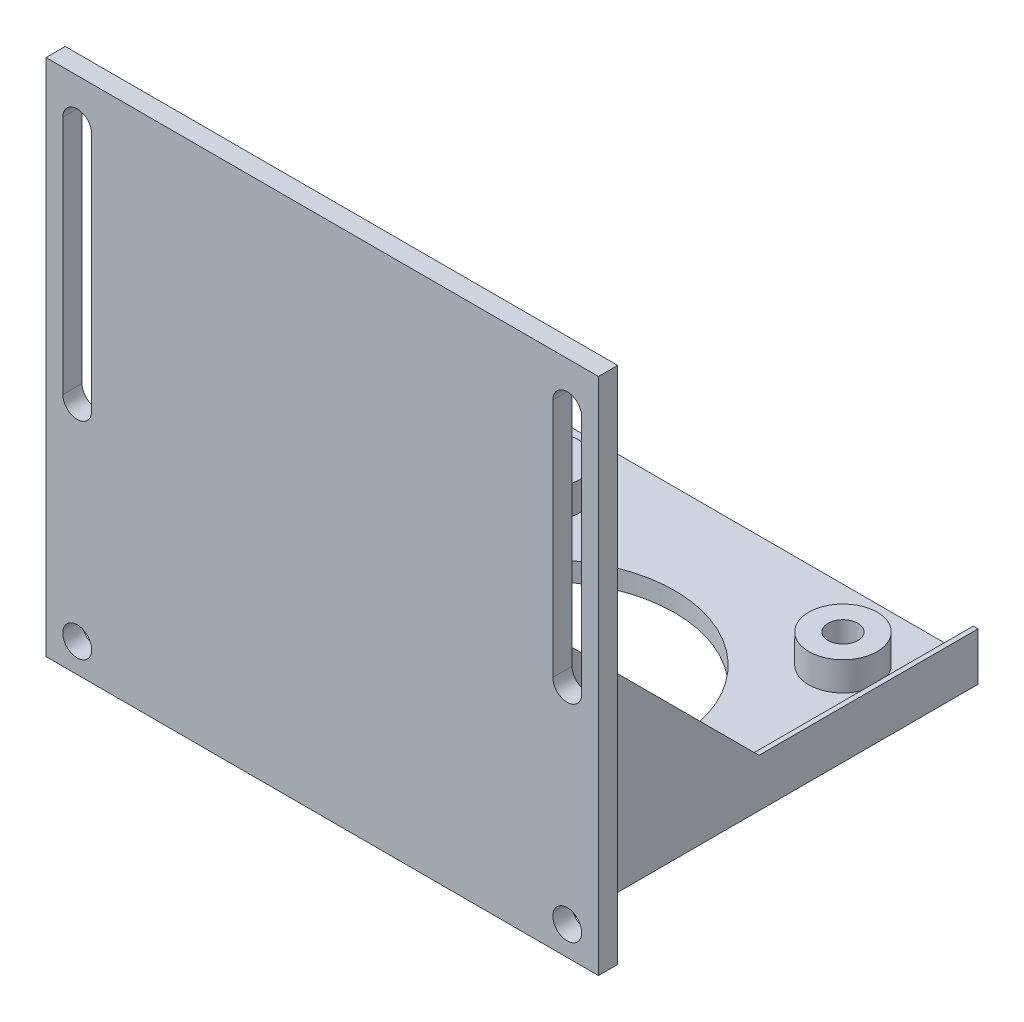
ISO-10303-21;
HEADER;
FILE_DESCRIPTION(('STEP AP214'),'2;1');
FILE_NAME('part.step','',(''),(''),'','','');
FILE_SCHEMA(('AUTOMOTIVE_DESIGN { 1 0 10303 214 1 1 1 1 }'));
ENDSEC;
DATA;
#1=APPLICATION_CONTEXT('core data for automotive mechanical design processes');
#2=APPLICATION_PROTOCOL_DEFINITION('international standard','automotive_design',2000,#1);
#3=PRODUCT_CONTEXT('',#1,'mechanical');
#4=PRODUCT('Part','Part','',(#3));
#5=PRODUCT_RELATED_PRODUCT_CATEGORY('part','',(#4));
#6=PRODUCT_DEFINITION_FORMATION('','',#4);
#7=PRODUCT_DEFINITION_CONTEXT('part definition',#1,'design');
#8=PRODUCT_DEFINITION('design','',#6,#7);
#9=PRODUCT_DEFINITION_SHAPE('','',#8);
#10=(LENGTH_UNIT() NAMED_UNIT(*) SI_UNIT(.MILLI.,.METRE.));
#11=(NAMED_UNIT(*) PLANE_ANGLE_UNIT() SI_UNIT($,.RADIAN.));
#12=(NAMED_UNIT(*) SI_UNIT($,.STERADIAN.) SOLID_ANGLE_UNIT());
#13=UNCERTAINTY_MEASURE_WITH_UNIT(LENGTH_MEASURE(1.E-05),#10,'distance_accuracy_value','');
#14=(GEOMETRIC_REPRESENTATION_CONTEXT(3) GLOBAL_UNCERTAINTY_ASSIGNED_CONTEXT((#13)) GLOBAL_UNIT_ASSIGNED_CONTEXT((#10,
#11,#12)) REPRESENTATION_CONTEXT('',''));
#15=CARTESIAN_POINT('',(0.,0.,0.));
#16=DIRECTION('',(0.,0.,1.));
#17=DIRECTION('',(1.,0.,0.));
#18=AXIS2_PLACEMENT_3D('',#15,#16,#17);
#19=CARTESIAN_POINT('',(-21.75,-3.,43.6033255612459));
#20=DIRECTION('',(0.,-1.,0.));
#21=DIRECTION('',(1.,0.,0.));
#22=AXIS2_PLACEMENT_3D('',#19,#20,#21);
#23=PLANE('',#22);
#24=CARTESIAN_POINT('',(15.494,-3.,-5.715));
#25=DIRECTION('',(0.,-1.,0.));
#26=DIRECTION('',(1.,0.,0.));
#27=AXIS2_PLACEMENT_3D('',#24,#25,#26);
#28=CIRCLE('',#27,3.55412658773653);
#29=CARTESIAN_POINT('',(19.0481265877365,-3.00000000000001,-5.715));
#30=VERTEX_POINT('',#29);
#31=EDGE_CURVE('E42',#30,#30,#28,.F.);
#32=ORIENTED_EDGE('',*,*,#31,.F.);
#33=EDGE_LOOP('',(#32));
#34=FACE_BOUND('',#33,.T.);
#35=CARTESIAN_POINT('',(-15.494,-3.,-36.703));
#36=DIRECTION('',(0.,-1.,0.));
#37=DIRECTION('',(1.,0.,0.));
#38=AXIS2_PLACEMENT_3D('',#35,#36,#37);
#39=CIRCLE('',#38,3.55412658773653);
#40=CARTESIAN_POINT('',(-11.9398734122635,-3.,-36.703));
#41=VERTEX_POINT('',#40);
#42=EDGE_CURVE('E111',#41,#41,#39,.F.);
#43=ORIENTED_EDGE('',*,*,#42,.F.);
#44=EDGE_LOOP('',(#43));
#45=FACE_BOUND('',#44,.T.);
#46=CARTESIAN_POINT('',(0.,-3.,-21.209));
#47=DIRECTION('',(0.,-1.,0.));
#48=DIRECTION('',(1.,0.,0.));
#49=AXIS2_PLACEMENT_3D('',#46,#47,#48);
#50=CIRCLE('',#49,13.462);
#51=CARTESIAN_POINT('',(13.462,-3.,-21.209));
#52=VERTEX_POINT('',#51);
#53=EDGE_CURVE('E130',#52,#52,#50,.T.);
#54=ORIENTED_EDGE('',*,*,#53,.T.);
#55=EDGE_LOOP('',(#54));
#56=FACE_BOUND('',#55,.T.);
#57=DIRECTION('',(0.,0.,-1.));
#58=VECTOR('',#57,1.);
#59=CARTESIAN_POINT('',(21.75,-3.00000000000001,43.6033255612459));
#60=LINE('',#59,#58);
#61=CARTESIAN_POINT('',(21.75,-3.00000000000001,0.));
#62=VERTEX_POINT('',#61);
#63=CARTESIAN_POINT('',(21.75,-3.00000000000001,-44.));
#64=VERTEX_POINT('',#63);
#65=EDGE_CURVE('E137',#62,#64,#60,.T.);
#66=ORIENTED_EDGE('',*,*,#65,.T.);
#67=DIRECTION('',(-1.,0.,0.));
#68=VECTOR('',#67,1.);
#69=CARTESIAN_POINT('',(-21.75,-3.,-44.));
#70=LINE('',#69,#68);
#71=CARTESIAN_POINT('',(-21.75,-3.,-44.));
#72=VERTEX_POINT('',#71);
#73=EDGE_CURVE('E587',#64,#72,#70,.T.);
#74=ORIENTED_EDGE('',*,*,#73,.T.);
#75=DIRECTION('',(0.,0.,-1.));
#76=VECTOR('',#75,1.);
#77=CARTESIAN_POINT('',(-21.75,-3.,43.6033255612459));
#78=LINE('',#77,#76);
#79=CARTESIAN_POINT('',(-21.75,-3.,0.));
#80=VERTEX_POINT('',#79);
#81=EDGE_CURVE('E583',#80,#72,#78,.T.);
#82=ORIENTED_EDGE('',*,*,#81,.F.);
#83=DIRECTION('',(-1.,0.,0.));
#84=VECTOR('',#83,1.);
#85=CARTESIAN_POINT('',(-21.75,-3.,0.));
#86=LINE('',#85,#84);
#87=EDGE_CURVE('E589',#62,#80,#86,.T.);
#88=ORIENTED_EDGE('',*,*,#87,.F.);
#89=EDGE_LOOP('',(#66,#74,#82,#88));
#90=FACE_BOUND('',#89,.T.);
#91=CARTESIAN_POINT('',(15.494,-3.,-36.703));
#92=DIRECTION('',(0.,-1.,0.));
#93=DIRECTION('',(1.,0.,0.));
#94=AXIS2_PLACEMENT_3D('',#91,#92,#93);
#95=CIRCLE('',#94,3.55412658773653);
#96=CARTESIAN_POINT('',(19.0481265877365,-3.00000000000001,-36.703));
#97=VERTEX_POINT('',#96);
#98=EDGE_CURVE('E114',#97,#97,#95,.F.);
#99=ORIENTED_EDGE('',*,*,#98,.F.);
#100=EDGE_LOOP('',(#99));
#101=FACE_BOUND('',#100,.T.);
#102=CARTESIAN_POINT('',(-15.494,-3.,-5.71500000000001));
#103=DIRECTION('',(0.,-1.,0.));
#104=DIRECTION('',(1.,0.,0.));
#105=AXIS2_PLACEMENT_3D('',#102,#103,#104);
#106=CIRCLE('',#105,3.55412658773653);
#107=CARTESIAN_POINT('',(-11.9398734122635,-3.,-5.71500000000001));
#108=VERTEX_POINT('',#107);
#109=EDGE_CURVE('E11',#108,#108,#106,.F.);
#110=ORIENTED_EDGE('',*,*,#109,.F.);
#111=EDGE_LOOP('',(#110));
#112=FACE_BOUND('',#111,.T.);
#113=ADVANCED_FACE('F34',(#34,#45,#56,#90,#101,#112),#23,.F.);
#114=CARTESIAN_POINT('',(0.,0.,0.));
#115=DIRECTION('',(0.,-1.,0.));
#116=DIRECTION('',(0.,0.,-1.));
#117=AXIS2_PLACEMENT_3D('',#114,#115,#116);
#118=PLANE('',#117);
#119=DIRECTION('',(1.,0.,0.));
#120=VECTOR('',#119,1.);
#121=CARTESIAN_POINT('',(22.25,0.,-44.));
#122=LINE('',#121,#120);
#123=CARTESIAN_POINT('',(21.75,0.,-44.));
#124=VERTEX_POINT('',#123);
#125=CARTESIAN_POINT('',(22.25,0.,-44.));
#126=VERTEX_POINT('',#125);
#127=EDGE_CURVE('E71',#124,#126,#122,.T.);
#128=ORIENTED_EDGE('',*,*,#127,.F.);
#129=DIRECTION('',(0.,0.,-1.));
#130=VECTOR('',#129,1.);
#131=CARTESIAN_POINT('',(21.75,0.,43.6033255612459));
#132=LINE('',#131,#130);
#133=CARTESIAN_POINT('',(21.75,0.,-21.209));
#134=VERTEX_POINT('',#133);
#135=EDGE_CURVE('E584',#134,#124,#132,.T.);
#136=ORIENTED_EDGE('',*,*,#135,.F.);
#137=DIRECTION('',(1.,0.,0.));
#138=VECTOR('',#137,1.);
#139=CARTESIAN_POINT('',(21.75,0.,-21.209));
#140=LINE('',#139,#138);
#141=CARTESIAN_POINT('',(22.25,0.,-21.209));
#142=VERTEX_POINT('',#141);
#143=EDGE_CURVE('E97',#134,#142,#140,.T.);
#144=ORIENTED_EDGE('',*,*,#143,.T.);
#145=DIRECTION('',(0.,0.,1.));
#146=VECTOR('',#145,1.);
#147=CARTESIAN_POINT('',(22.25,0.,-44.));
#148=LINE('',#147,#146);
#149=EDGE_CURVE('E90',#126,#142,#148,.T.);
#150=ORIENTED_EDGE('',*,*,#149,.F.);
#151=EDGE_LOOP('',(#128,#136,#144,#150));
#152=FACE_BOUND('',#151,.T.);
#153=ADVANCED_FACE('F95',(#152),#118,.F.);
#154=DIRECTION('',(-1.,0.,0.));
#155=VECTOR('',#154,1.);
#156=CARTESIAN_POINT('',(-21.75,0.,-21.209));
#157=LINE('',#156,#155);
#158=CARTESIAN_POINT('',(-21.75,0.,-21.209));
#159=VERTEX_POINT('',#158);
#160=CARTESIAN_POINT('',(-22.25,0.,-21.209));
#161=VERTEX_POINT('',#160);
#162=EDGE_CURVE('E374',#159,#161,#157,.T.);
#163=ORIENTED_EDGE('',*,*,#162,.F.);
#164=DIRECTION('',(0.,0.,-1.));
#165=VECTOR('',#164,1.);
#166=CARTESIAN_POINT('',(-21.75,0.,43.6033255612459));
#167=LINE('',#166,#165);
#168=CARTESIAN_POINT('',(-21.75,0.,-44.));
#169=VERTEX_POINT('',#168);
#170=EDGE_CURVE('E486',#159,#169,#167,.T.);
#171=ORIENTED_EDGE('',*,*,#170,.T.);
#172=CARTESIAN_POINT('',(-22.25,0.,-44.));
#173=VERTEX_POINT('',#172);
#174=EDGE_CURVE('E83',#173,#169,#122,.T.);
#175=ORIENTED_EDGE('',*,*,#174,.F.);
#176=DIRECTION('',(0.,0.,-1.));
#177=VECTOR('',#176,1.);
#178=CARTESIAN_POINT('',(-22.25,0.,-44.));
#179=LINE('',#178,#177);
#180=EDGE_CURVE('E84',#161,#173,#179,.T.);
#181=ORIENTED_EDGE('',*,*,#180,.F.);
#182=EDGE_LOOP('',(#163,#171,#175,#181));
#183=FACE_BOUND('',#182,.T.);
#184=ADVANCED_FACE('F250',(#183),#118,.F.);
#185=CARTESIAN_POINT('',(0.,0.,0.));
#186=DIRECTION('',(0.,0.,1.));
#187=DIRECTION('',(1.,0.,0.));
#188=AXIS2_PLACEMENT_3D('',#185,#186,#187);
#189=PLANE('',#188);
#190=CARTESIAN_POINT('',(-25.5,-1.99999999999999,0.));
#191=DIRECTION('',(0.,0.,-1.));
#192=DIRECTION('',(-1.,0.,0.));
#193=AXIS2_PLACEMENT_3D('',#190,#191,#192);
#194=CIRCLE('',#193,1.5);
#195=CARTESIAN_POINT('',(-27.,-1.99999999999999,0.));
#196=VERTEX_POINT('',#195);
#197=EDGE_CURVE('E320',#196,#196,#194,.T.);
#198=ORIENTED_EDGE('',*,*,#197,.F.);
#199=EDGE_LOOP('',(#198));
#200=FACE_BOUND('',#199,.T.);
#201=DIRECTION('',(0.,-1.,0.));
#202=VECTOR('',#201,1.);
#203=CARTESIAN_POINT('',(-24.,44.5,0.));
#204=LINE('',#203,#202);
#205=CARTESIAN_POINT('',(-24.,44.5,0.));
#206=VERTEX_POINT('',#205);
#207=CARTESIAN_POINT('',(-24.,19.5,0.));
#208=VERTEX_POINT('',#207);
#209=EDGE_CURVE('E310',#206,#208,#204,.T.);
#210=ORIENTED_EDGE('',*,*,#209,.F.);
#211=CARTESIAN_POINT('',(-25.5,44.5,0.));
#212=DIRECTION('',(0.,0.,-1.));
#213=DIRECTION('',(-1.,0.,0.));
#214=AXIS2_PLACEMENT_3D('',#211,#212,#213);
#215=CIRCLE('',#214,1.49999999999999);
#216=CARTESIAN_POINT('',(-27.,44.5,0.));
#217=VERTEX_POINT('',#216);
#218=EDGE_CURVE('E332',#217,#206,#215,.T.);
#219=ORIENTED_EDGE('',*,*,#218,.F.);
#220=DIRECTION('',(0.,1.,0.));
#221=VECTOR('',#220,1.);
#222=CARTESIAN_POINT('',(-27.,44.5,0.));
#223=LINE('',#222,#221);
#224=CARTESIAN_POINT('',(-27.,19.5,0.));
#225=VERTEX_POINT('',#224);
#226=EDGE_CURVE('E324',#225,#217,#223,.T.);
#227=ORIENTED_EDGE('',*,*,#226,.F.);
#228=CARTESIAN_POINT('',(-25.5,19.5,0.));
#229=DIRECTION('',(0.,0.,-1.));
#230=DIRECTION('',(-1.,0.,0.));
#231=AXIS2_PLACEMENT_3D('',#228,#229,#230);
#232=CIRCLE('',#231,1.49999999999999);
#233=EDGE_CURVE('E329',#208,#225,#232,.T.);
#234=ORIENTED_EDGE('',*,*,#233,.F.);
#235=EDGE_LOOP('',(#210,#219,#227,#234));
#236=FACE_BOUND('',#235,.T.);
#237=DIRECTION('',(1.,0.,0.));
#238=VECTOR('',#237,1.);
#239=CARTESIAN_POINT('',(21.75,21.2090000000002,0.));
#240=LINE('',#239,#238);
#241=CARTESIAN_POINT('',(21.75,21.2090000000002,0.));
#242=VERTEX_POINT('',#241);
#243=CARTESIAN_POINT('',(22.25,21.2090000000002,0.));
#244=VERTEX_POINT('',#243);
#245=EDGE_CURVE('E352',#242,#244,#240,.T.);
#246=ORIENTED_EDGE('',*,*,#245,.F.);
#247=DIRECTION('',(0.,1.,0.));
#248=VECTOR('',#247,1.);
#249=CARTESIAN_POINT('',(21.75,0.,0.));
#250=LINE('',#249,#248);
#251=EDGE_CURVE('E432',#62,#242,#250,.T.);
#252=ORIENTED_EDGE('',*,*,#251,.F.);
#253=ORIENTED_EDGE('',*,*,#87,.T.);
#254=DIRECTION('',(0.,1.,0.));
#255=VECTOR('',#254,1.);
#256=CARTESIAN_POINT('',(-21.75,0.,0.));
#257=LINE('',#256,#255);
#258=CARTESIAN_POINT('',(-21.75,21.2090000000002,0.));
#259=VERTEX_POINT('',#258);
#260=EDGE_CURVE('E366',#80,#259,#257,.T.);
#261=ORIENTED_EDGE('',*,*,#260,.T.);
#262=DIRECTION('',(-1.,0.,0.));
#263=VECTOR('',#262,1.);
#264=CARTESIAN_POINT('',(-21.75,21.2090000000002,0.));
#265=LINE('',#264,#263);
#266=CARTESIAN_POINT('',(-22.25,21.2090000000002,0.));
#267=VERTEX_POINT('',#266);
#268=EDGE_CURVE('E372',#259,#267,#265,.T.);
#269=ORIENTED_EDGE('',*,*,#268,.T.);
#270=DIRECTION('',(0.,-1.,0.));
#271=VECTOR('',#270,1.);
#272=CARTESIAN_POINT('',(-22.25,-5.,0.));
#273=LINE('',#272,#271);
#274=CARTESIAN_POINT('',(-22.25,-5.,0.));
#275=VERTEX_POINT('',#274);
#276=EDGE_CURVE('E110',#267,#275,#273,.T.);
#277=ORIENTED_EDGE('',*,*,#276,.T.);
#278=DIRECTION('',(-1.,0.,0.));
#279=VECTOR('',#278,1.);
#280=CARTESIAN_POINT('',(-22.25,-5.,0.));
#281=LINE('',#280,#279);
#282=CARTESIAN_POINT('',(-28.75,-5.,0.));
#283=VERTEX_POINT('',#282);
#284=EDGE_CURVE('E301',#275,#283,#281,.T.);
#285=ORIENTED_EDGE('',*,*,#284,.T.);
#286=DIRECTION('',(0.,1.,0.));
#287=VECTOR('',#286,1.);
#288=CARTESIAN_POINT('',(-28.75,-5.,0.));
#289=LINE('',#288,#287);
#290=CARTESIAN_POINT('',(-28.75,49.,0.));
#291=VERTEX_POINT('',#290);
#292=EDGE_CURVE('E309',#283,#291,#289,.T.);
#293=ORIENTED_EDGE('',*,*,#292,.T.);
#294=DIRECTION('',(-1.,0.,0.));
#295=VECTOR('',#294,1.);
#296=CARTESIAN_POINT('',(22.25,49.,0.));
#297=LINE('',#296,#295);
#298=CARTESIAN_POINT('',(28.75,49.,0.));
#299=VERTEX_POINT('',#298);
#300=EDGE_CURVE('E377',#299,#291,#297,.T.);
#301=ORIENTED_EDGE('',*,*,#300,.F.);
#302=DIRECTION('',(0.,1.,0.));
#303=VECTOR('',#302,1.);
#304=CARTESIAN_POINT('',(28.75,-5.,0.));
#305=LINE('',#304,#303);
#306=CARTESIAN_POINT('',(28.75,-5.,0.));
#307=VERTEX_POINT('',#306);
#308=EDGE_CURVE('E408',#307,#299,#305,.T.);
#309=ORIENTED_EDGE('',*,*,#308,.F.);
#310=DIRECTION('',(1.,0.,0.));
#311=VECTOR('',#310,1.);
#312=CARTESIAN_POINT('',(22.25,-5.,0.));
#313=LINE('',#312,#311);
#314=CARTESIAN_POINT('',(22.25,-5.,0.));
#315=VERTEX_POINT('',#314);
#316=EDGE_CURVE('E49',#315,#307,#313,.T.);
#317=ORIENTED_EDGE('',*,*,#316,.F.);
#318=DIRECTION('',(0.,-1.,0.));
#319=VECTOR('',#318,1.);
#320=CARTESIAN_POINT('',(22.25,-5.,0.));
#321=LINE('',#320,#319);
#322=EDGE_CURVE('E115',#244,#315,#321,.T.);
#323=ORIENTED_EDGE('',*,*,#322,.F.);
#324=EDGE_LOOP('',(#246,#252,#253,#261,#269,#277,#285,#293,#301,#309,#317,#323));
#325=FACE_BOUND('',#324,.T.);
#326=CARTESIAN_POINT('',(25.5,-1.99999999999999,0.));
#327=DIRECTION('',(0.,0.,1.));
#328=DIRECTION('',(1.,0.,0.));
#329=AXIS2_PLACEMENT_3D('',#326,#327,#328);
#330=CIRCLE('',#329,1.5);
#331=CARTESIAN_POINT('',(27.,-1.99999999999999,0.));
#332=VERTEX_POINT('',#331);
#333=EDGE_CURVE('E416',#332,#332,#330,.T.);
#334=ORIENTED_EDGE('',*,*,#333,.T.);
#335=EDGE_LOOP('',(#334));
#336=FACE_BOUND('',#335,.T.);
#337=CARTESIAN_POINT('',(25.5,44.5,0.));
#338=DIRECTION('',(0.,0.,1.));
#339=DIRECTION('',(1.,0.,0.));
#340=AXIS2_PLACEMENT_3D('',#337,#338,#339);
#341=CIRCLE('',#340,1.49999999999999);
#342=CARTESIAN_POINT('',(27.,44.5,0.));
#343=VERTEX_POINT('',#342);
#344=CARTESIAN_POINT('',(24.,44.5,0.));
#345=VERTEX_POINT('',#344);
#346=EDGE_CURVE('E535',#343,#345,#341,.T.);
#347=ORIENTED_EDGE('',*,*,#346,.T.);
#348=DIRECTION('',(0.,-1.,0.));
#349=VECTOR('',#348,1.);
#350=CARTESIAN_POINT('',(24.,44.5,0.));
#351=LINE('',#350,#349);
#352=CARTESIAN_POINT('',(24.,19.5,0.));
#353=VERTEX_POINT('',#352);
#354=EDGE_CURVE('E551',#345,#353,#351,.T.);
#355=ORIENTED_EDGE('',*,*,#354,.T.);
#356=CARTESIAN_POINT('',(25.5,19.5,0.));
#357=DIRECTION('',(0.,0.,1.));
#358=DIRECTION('',(1.,0.,0.));
#359=AXIS2_PLACEMENT_3D('',#356,#357,#358);
#360=CIRCLE('',#359,1.49999999999999);
#361=CARTESIAN_POINT('',(27.,19.5,0.));
#362=VERTEX_POINT('',#361);
#363=EDGE_CURVE('E548',#353,#362,#360,.T.);
#364=ORIENTED_EDGE('',*,*,#363,.T.);
#365=DIRECTION('',(0.,1.,0.));
#366=VECTOR('',#365,1.);
#367=CARTESIAN_POINT('',(27.,44.5,0.));
#368=LINE('',#367,#366);
#369=EDGE_CURVE('E539',#362,#343,#368,.T.);
#370=ORIENTED_EDGE('',*,*,#369,.T.);
#371=EDGE_LOOP('',(#347,#355,#364,#370));
#372=FACE_BOUND('',#371,.T.);
#373=ADVANCED_FACE('F246',(#200,#236,#325,#336,#372),#189,.F.);
#374=CARTESIAN_POINT('',(-22.25,-5.,-44.));
#375=DIRECTION('',(1.,0.,0.));
#376=DIRECTION('',(0.,0.,-1.));
#377=AXIS2_PLACEMENT_3D('',#374,#375,#376);
#378=PLANE('',#377);
#379=DIRECTION('',(0.,0.,-1.));
#380=VECTOR('',#379,1.);
#381=CARTESIAN_POINT('',(-22.25,-5.,-44.));
#382=LINE('',#381,#380);
#383=CARTESIAN_POINT('',(-22.25,-5.,-44.));
#384=VERTEX_POINT('',#383);
#385=EDGE_CURVE('E290',#275,#384,#382,.T.);
#386=ORIENTED_EDGE('',*,*,#385,.F.);
#387=ORIENTED_EDGE('',*,*,#276,.F.);
#388=DIRECTION('',(0.,-0.707106781186551,-0.707106781186544));
#389=VECTOR('',#388,1.);
#390=CARTESIAN_POINT('',(-22.25,0.,-21.209));
#391=LINE('',#390,#389);
#392=EDGE_CURVE('E338',#267,#161,#391,.T.);
#393=ORIENTED_EDGE('',*,*,#392,.T.);
#394=ORIENTED_EDGE('',*,*,#180,.T.);
#395=DIRECTION('',(0.,1.,0.));
#396=VECTOR('',#395,1.);
#397=CARTESIAN_POINT('',(-22.25,-5.,-44.));
#398=LINE('',#397,#396);
#399=EDGE_CURVE('E92',#384,#173,#398,.T.);
#400=ORIENTED_EDGE('',*,*,#399,.F.);
#401=EDGE_LOOP('',(#386,#387,#393,#394,#400));
#402=FACE_BOUND('',#401,.T.);
#403=ADVANCED_FACE('F249',(#402),#378,.F.);
#404=CARTESIAN_POINT('',(0.,-5.,0.));
#405=DIRECTION('',(0.,-1.,0.));
#406=DIRECTION('',(0.,0.,-1.));
#407=AXIS2_PLACEMENT_3D('',#404,#405,#406);
#408=PLANE('',#407);
#409=ORIENTED_EDGE('',*,*,#284,.F.);
#410=ORIENTED_EDGE('',*,*,#385,.T.);
#411=DIRECTION('',(1.,0.,0.));
#412=VECTOR('',#411,1.);
#413=CARTESIAN_POINT('',(22.25,-5.,-44.));
#414=LINE('',#413,#412);
#415=CARTESIAN_POINT('',(22.25,-5.,-44.));
#416=VERTEX_POINT('',#415);
#417=EDGE_CURVE('E58',#384,#416,#414,.T.);
#418=ORIENTED_EDGE('',*,*,#417,.T.);
#419=DIRECTION('',(0.,0.,1.));
#420=VECTOR('',#419,1.);
#421=CARTESIAN_POINT('',(22.25,-5.,-44.));
#422=LINE('',#421,#420);
#423=EDGE_CURVE('E91',#416,#315,#422,.T.);
#424=ORIENTED_EDGE('',*,*,#423,.T.);
#425=ORIENTED_EDGE('',*,*,#316,.T.);
#426=DIRECTION('',(0.,0.,-1.));
#427=VECTOR('',#426,1.);
#428=CARTESIAN_POINT('',(28.75,-5.,56.3897968372745));
#429=LINE('',#428,#427);
#430=CARTESIAN_POINT('',(28.75,-5.,2.));
#431=VERTEX_POINT('',#430);
#432=EDGE_CURVE('E403',#431,#307,#429,.T.);
#433=ORIENTED_EDGE('',*,*,#432,.F.);
#434=DIRECTION('',(1.,0.,0.));
#435=VECTOR('',#434,1.);
#436=CARTESIAN_POINT('',(22.25,-5.,2.));
#437=LINE('',#436,#435);
#438=CARTESIAN_POINT('',(-28.75,-5.,2.));
#439=VERTEX_POINT('',#438);
#440=EDGE_CURVE('E383',#439,#431,#437,.T.);
#441=ORIENTED_EDGE('',*,*,#440,.F.);
#442=DIRECTION('',(0.,0.,-1.));
#443=VECTOR('',#442,1.);
#444=CARTESIAN_POINT('',(-28.75,-5.,56.3897968372745));
#445=LINE('',#444,#443);
#446=EDGE_CURVE('E306',#439,#283,#445,.T.);
#447=ORIENTED_EDGE('',*,*,#446,.T.);
#448=EDGE_LOOP('',(#409,#410,#418,#424,#425,#433,#441,#447));
#449=FACE_BOUND('',#448,.T.);
#450=CARTESIAN_POINT('',(-15.494,-5.,-36.703));
#451=DIRECTION('',(0.,-1.,0.));
#452=DIRECTION('',(0.,0.,-1.));
#453=AXIS2_PLACEMENT_3D('',#450,#451,#452);
#454=CIRCLE('',#453,1.55412658773653);
#455=CARTESIAN_POINT('',(-15.494,-5.,-38.2571265877365));
#456=VERTEX_POINT('',#455);
#457=EDGE_CURVE('E391',#456,#456,#454,.T.);
#458=ORIENTED_EDGE('',*,*,#457,.F.);
#459=EDGE_LOOP('',(#458));
#460=FACE_BOUND('',#459,.T.);
#461=CARTESIAN_POINT('',(15.494,-5.,-5.715));
#462=DIRECTION('',(0.,-1.,0.));
#463=DIRECTION('',(0.,0.,-1.));
#464=AXIS2_PLACEMENT_3D('',#461,#462,#463);
#465=CIRCLE('',#464,1.55412658773653);
#466=CARTESIAN_POINT('',(15.494,-5.,-7.26912658773653));
#467=VERTEX_POINT('',#466);
#468=EDGE_CURVE('E102',#467,#467,#465,.T.);
#469=ORIENTED_EDGE('',*,*,#468,.F.);
#470=EDGE_LOOP('',(#469));
#471=FACE_BOUND('',#470,.T.);
#472=CARTESIAN_POINT('',(0.,-5.,-21.209));
#473=DIRECTION('',(0.,-1.,0.));
#474=DIRECTION('',(0.,0.,-1.));
#475=AXIS2_PLACEMENT_3D('',#472,#473,#474);
#476=CIRCLE('',#475,13.462);
#477=CARTESIAN_POINT('',(0.,-5.,-34.671));
#478=VERTEX_POINT('',#477);
#479=EDGE_CURVE('E98',#478,#478,#476,.T.);
#480=ORIENTED_EDGE('',*,*,#479,.F.);
#481=EDGE_LOOP('',(#480));
#482=FACE_BOUND('',#481,.T.);
#483=CARTESIAN_POINT('',(-15.494,-5.,-5.71500000000001));
#484=DIRECTION('',(0.,-1.,0.));
#485=DIRECTION('',(0.,0.,-1.));
#486=AXIS2_PLACEMENT_3D('',#483,#484,#485);
#487=CIRCLE('',#486,1.55412658773653);
#488=CARTESIAN_POINT('',(-15.494,-5.,-7.26912658773653));
#489=VERTEX_POINT('',#488);
#490=EDGE_CURVE('E394',#489,#489,#487,.T.);
#491=ORIENTED_EDGE('',*,*,#490,.F.);
#492=EDGE_LOOP('',(#491));
#493=FACE_BOUND('',#492,.T.);
#494=CARTESIAN_POINT('',(15.494,-5.,-36.703));
#495=DIRECTION('',(0.,-1.,0.));
#496=DIRECTION('',(0.,0.,-1.));
#497=AXIS2_PLACEMENT_3D('',#494,#495,#496);
#498=CIRCLE('',#497,1.55412658773653);
#499=CARTESIAN_POINT('',(15.494,-5.,-38.2571265877365));
#500=VERTEX_POINT('',#499);
#501=EDGE_CURVE('E386',#500,#500,#498,.T.);
#502=ORIENTED_EDGE('',*,*,#501,.F.);
#503=EDGE_LOOP('',(#502));
#504=FACE_BOUND('',#503,.T.);
#505=ADVANCED_FACE('F275',(#449,#460,#471,#482,#493,#504),#408,.T.);
#506=CARTESIAN_POINT('',(22.25,-5.,-44.));
#507=DIRECTION('',(-1.,0.,0.));
#508=DIRECTION('',(0.,0.,1.));
#509=AXIS2_PLACEMENT_3D('',#506,#507,#508);
#510=PLANE('',#509);
#511=DIRECTION('',(0.,-0.707106781186551,-0.707106781186544));
#512=VECTOR('',#511,1.);
#513=CARTESIAN_POINT('',(22.25,0.,-21.209));
#514=LINE('',#513,#512);
#515=EDGE_CURVE('E428',#244,#142,#514,.T.);
#516=ORIENTED_EDGE('',*,*,#515,.F.);
#517=ORIENTED_EDGE('',*,*,#322,.T.);
#518=ORIENTED_EDGE('',*,*,#423,.F.);
#519=DIRECTION('',(0.,1.,0.));
#520=VECTOR('',#519,1.);
#521=CARTESIAN_POINT('',(22.25,-5.,-44.));
#522=LINE('',#521,#520);
#523=EDGE_CURVE('E75',#416,#126,#522,.T.);
#524=ORIENTED_EDGE('',*,*,#523,.T.);
#525=ORIENTED_EDGE('',*,*,#149,.T.);
#526=EDGE_LOOP('',(#516,#517,#518,#524,#525));
#527=FACE_BOUND('',#526,.T.);
#528=ADVANCED_FACE('F36',(#527),#510,.F.);
#529=CARTESIAN_POINT('',(22.25,-5.,-44.));
#530=DIRECTION('',(0.,0.,1.));
#531=DIRECTION('',(1.,0.,0.));
#532=AXIS2_PLACEMENT_3D('',#529,#530,#531);
#533=PLANE('',#532);
#534=ORIENTED_EDGE('',*,*,#73,.F.);
#535=DIRECTION('',(0.,-1.,0.));
#536=VECTOR('',#535,1.);
#537=CARTESIAN_POINT('',(21.75,0.,-44.));
#538=LINE('',#537,#536);
#539=EDGE_CURVE('E79',#124,#64,#538,.T.);
#540=ORIENTED_EDGE('',*,*,#539,.F.);
#541=ORIENTED_EDGE('',*,*,#127,.T.);
#542=ORIENTED_EDGE('',*,*,#523,.F.);
#543=ORIENTED_EDGE('',*,*,#417,.F.);
#544=ORIENTED_EDGE('',*,*,#399,.T.);
#545=ORIENTED_EDGE('',*,*,#174,.T.);
#546=DIRECTION('',(0.,1.,0.));
#547=VECTOR('',#546,1.);
#548=CARTESIAN_POINT('',(-21.75,0.,-44.));
#549=LINE('',#548,#547);
#550=EDGE_CURVE('E490',#72,#169,#549,.T.);
#551=ORIENTED_EDGE('',*,*,#550,.F.);
#552=EDGE_LOOP('',(#534,#540,#541,#542,#543,#544,#545,#551));
#553=FACE_BOUND('',#552,.T.);
#554=ADVANCED_FACE('F74',(#553),#533,.F.);
#555=CARTESIAN_POINT('',(0.,-5.,-21.209));
#556=DIRECTION('',(0.,1.,0.));
#557=DIRECTION('',(0.,0.,1.));
#558=AXIS2_PLACEMENT_3D('',#555,#556,#557);
#559=CYLINDRICAL_SURFACE('',#558,13.462);
#560=ORIENTED_EDGE('',*,*,#53,.F.);
#561=EDGE_LOOP('',(#560));
#562=FACE_BOUND('',#561,.T.);
#563=ORIENTED_EDGE('',*,*,#479,.T.);
#564=EDGE_LOOP('',(#563));
#565=FACE_BOUND('',#564,.T.);
#566=ADVANCED_FACE('F270',(#562,#565),#559,.F.);
#567=CARTESIAN_POINT('',(15.494,-5.,-5.715));
#568=DIRECTION('',(0.,1.,0.));
#569=DIRECTION('',(0.,0.,1.));
#570=AXIS2_PLACEMENT_3D('',#567,#568,#569);
#571=CYLINDRICAL_SURFACE('',#570,1.55412658773653);
#572=ORIENTED_EDGE('',*,*,#468,.T.);
#573=EDGE_LOOP('',(#572));
#574=FACE_BOUND('',#573,.T.);
#575=CARTESIAN_POINT('',(15.494,0.,-5.715));
#576=DIRECTION('',(0.,1.,0.));
#577=DIRECTION('',(-1.,0.,0.));
#578=AXIS2_PLACEMENT_3D('',#575,#576,#577);
#579=CIRCLE('',#578,1.55412658773653);
#580=CARTESIAN_POINT('',(13.9398734122635,0.,-5.715));
#581=VERTEX_POINT('',#580);
#582=EDGE_CURVE('E610',#581,#581,#579,.T.);
#583=ORIENTED_EDGE('',*,*,#582,.T.);
#584=EDGE_LOOP('',(#583));
#585=FACE_BOUND('',#584,.T.);
#586=ADVANCED_FACE('F266',(#574,#585),#571,.F.);
#587=CARTESIAN_POINT('',(-15.494,-5.,-5.71500000000001));
#588=DIRECTION('',(0.,1.,0.));
#589=DIRECTION('',(0.,0.,1.));
#590=AXIS2_PLACEMENT_3D('',#587,#588,#589);
#591=CYLINDRICAL_SURFACE('',#590,1.55412658773653);
#592=ORIENTED_EDGE('',*,*,#490,.T.);
#593=EDGE_LOOP('',(#592));
#594=FACE_BOUND('',#593,.T.);
#595=CARTESIAN_POINT('',(-15.494,0.,-5.71500000000001));
#596=DIRECTION('',(0.,1.,0.));
#597=DIRECTION('',(-1.,0.,0.));
#598=AXIS2_PLACEMENT_3D('',#595,#596,#597);
#599=CIRCLE('',#598,1.55412658773653);
#600=CARTESIAN_POINT('',(-17.0481265877365,0.,-5.71500000000001));
#601=VERTEX_POINT('',#600);
#602=EDGE_CURVE('E616',#601,#601,#599,.T.);
#603=ORIENTED_EDGE('',*,*,#602,.T.);
#604=EDGE_LOOP('',(#603));
#605=FACE_BOUND('',#604,.T.);
#606=ADVANCED_FACE('F262',(#594,#605),#591,.F.);
#607=CARTESIAN_POINT('',(-15.494,-5.,-36.703));
#608=DIRECTION('',(0.,1.,0.));
#609=DIRECTION('',(0.,0.,1.));
#610=AXIS2_PLACEMENT_3D('',#607,#608,#609);
#611=CYLINDRICAL_SURFACE('',#610,1.55412658773653);
#612=ORIENTED_EDGE('',*,*,#457,.T.);
#613=EDGE_LOOP('',(#612));
#614=FACE_BOUND('',#613,.T.);
#615=CARTESIAN_POINT('',(-15.494,0.,-36.703));
#616=DIRECTION('',(0.,1.,0.));
#617=DIRECTION('',(-1.,0.,0.));
#618=AXIS2_PLACEMENT_3D('',#615,#616,#617);
#619=CIRCLE('',#618,1.55412658773653);
#620=CARTESIAN_POINT('',(-17.0481265877365,0.,-36.703));
#621=VERTEX_POINT('',#620);
#622=EDGE_CURVE('E598',#621,#621,#619,.T.);
#623=ORIENTED_EDGE('',*,*,#622,.T.);
#624=EDGE_LOOP('',(#623));
#625=FACE_BOUND('',#624,.T.);
#626=ADVANCED_FACE('F258',(#614,#625),#611,.F.);
#627=CARTESIAN_POINT('',(15.494,-5.,-36.703));
#628=DIRECTION('',(0.,1.,0.));
#629=DIRECTION('',(0.,0.,1.));
#630=AXIS2_PLACEMENT_3D('',#627,#628,#629);
#631=CYLINDRICAL_SURFACE('',#630,1.55412658773653);
#632=ORIENTED_EDGE('',*,*,#501,.T.);
#633=EDGE_LOOP('',(#632));
#634=FACE_BOUND('',#633,.T.);
#635=CARTESIAN_POINT('',(15.494,0.,-36.703));
#636=DIRECTION('',(0.,1.,0.));
#637=DIRECTION('',(-1.,0.,0.));
#638=AXIS2_PLACEMENT_3D('',#635,#636,#637);
#639=CIRCLE('',#638,1.55412658773653);
#640=CARTESIAN_POINT('',(13.9398734122635,0.,-36.703));
#641=VERTEX_POINT('',#640);
#642=EDGE_CURVE('E604',#641,#641,#639,.T.);
#643=ORIENTED_EDGE('',*,*,#642,.T.);
#644=EDGE_LOOP('',(#643));
#645=FACE_BOUND('',#644,.T.);
#646=ADVANCED_FACE('F254',(#634,#645),#631,.F.);
#647=CARTESIAN_POINT('',(22.25,49.,2.));
#648=DIRECTION('',(0.,-1.,0.));
#649=DIRECTION('',(0.,0.,-1.));
#650=AXIS2_PLACEMENT_3D('',#647,#648,#649);
#651=PLANE('',#650);
#652=DIRECTION('',(0.,0.,-1.));
#653=VECTOR('',#652,1.);
#654=CARTESIAN_POINT('',(-28.75,49.,56.3897968372745));
#655=LINE('',#654,#653);
#656=CARTESIAN_POINT('',(-28.75,49.,2.));
#657=VERTEX_POINT('',#656);
#658=EDGE_CURVE('E351',#657,#291,#655,.T.);
#659=ORIENTED_EDGE('',*,*,#658,.F.);
#660=DIRECTION('',(-1.,0.,0.));
#661=VECTOR('',#660,1.);
#662=CARTESIAN_POINT('',(22.25,49.,2.));
#663=LINE('',#662,#661);
#664=CARTESIAN_POINT('',(28.75,49.,2.));
#665=VERTEX_POINT('',#664);
#666=EDGE_CURVE('E380',#665,#657,#663,.T.);
#667=ORIENTED_EDGE('',*,*,#666,.F.);
#668=DIRECTION('',(0.,0.,-1.));
#669=VECTOR('',#668,1.);
#670=CARTESIAN_POINT('',(28.75,49.,56.3897968372745));
#671=LINE('',#670,#669);
#672=EDGE_CURVE('E407',#665,#299,#671,.T.);
#673=ORIENTED_EDGE('',*,*,#672,.T.);
#674=ORIENTED_EDGE('',*,*,#300,.T.);
#675=EDGE_LOOP('',(#659,#667,#673,#674));
#676=FACE_BOUND('',#675,.T.);
#677=ADVANCED_FACE('F244',(#676),#651,.F.);
#678=CARTESIAN_POINT('',(0.,0.,2.));
#679=DIRECTION('',(0.,0.,1.));
#680=DIRECTION('',(1.,0.,0.));
#681=AXIS2_PLACEMENT_3D('',#678,#679,#680);
#682=PLANE('',#681);
#683=ORIENTED_EDGE('',*,*,#440,.T.);
#684=DIRECTION('',(0.,1.,0.));
#685=VECTOR('',#684,1.);
#686=CARTESIAN_POINT('',(28.75,-5.,2.));
#687=LINE('',#686,#685);
#688=EDGE_CURVE('E533',#431,#665,#687,.T.);
#689=ORIENTED_EDGE('',*,*,#688,.T.);
#690=ORIENTED_EDGE('',*,*,#666,.T.);
#691=DIRECTION('',(0.,1.,0.));
#692=VECTOR('',#691,1.);
#693=CARTESIAN_POINT('',(-28.75,-5.,2.));
#694=LINE('',#693,#692);
#695=EDGE_CURVE('E348',#439,#657,#694,.T.);
#696=ORIENTED_EDGE('',*,*,#695,.F.);
#697=EDGE_LOOP('',(#683,#689,#690,#696));
#698=FACE_BOUND('',#697,.T.);
#699=DIRECTION('',(0.,1.,0.));
#700=VECTOR('',#699,1.);
#701=CARTESIAN_POINT('',(-27.,44.5,2.));
#702=LINE('',#701,#700);
#703=CARTESIAN_POINT('',(-27.,19.5,2.));
#704=VERTEX_POINT('',#703);
#705=CARTESIAN_POINT('',(-27.,44.5,2.));
#706=VERTEX_POINT('',#705);
#707=EDGE_CURVE('E312',#704,#706,#702,.T.);
#708=ORIENTED_EDGE('',*,*,#707,.T.);
#709=CARTESIAN_POINT('',(-25.5,44.5,2.));
#710=DIRECTION('',(0.,0.,1.));
#711=DIRECTION('',(1.,0.,0.));
#712=AXIS2_PLACEMENT_3D('',#709,#710,#711);
#713=CIRCLE('',#712,1.49999999999999);
#714=CARTESIAN_POINT('',(-24.,44.5,2.));
#715=VERTEX_POINT('',#714);
#716=EDGE_CURVE('E340',#706,#715,#713,.F.);
#717=ORIENTED_EDGE('',*,*,#716,.T.);
#718=DIRECTION('',(0.,-1.,0.));
#719=VECTOR('',#718,1.);
#720=CARTESIAN_POINT('',(-24.,44.5,2.));
#721=LINE('',#720,#719);
#722=CARTESIAN_POINT('',(-24.,19.5,2.));
#723=VERTEX_POINT('',#722);
#724=EDGE_CURVE('E343',#715,#723,#721,.T.);
#725=ORIENTED_EDGE('',*,*,#724,.T.);
#726=CARTESIAN_POINT('',(-25.5,19.5,2.));
#727=DIRECTION('',(0.,0.,1.));
#728=DIRECTION('',(1.,0.,0.));
#729=AXIS2_PLACEMENT_3D('',#726,#727,#728);
#730=CIRCLE('',#729,1.49999999999999);
#731=EDGE_CURVE('E339',#723,#704,#730,.F.);
#732=ORIENTED_EDGE('',*,*,#731,.T.);
#733=EDGE_LOOP('',(#708,#717,#725,#732));
#734=FACE_BOUND('',#733,.T.);
#735=CARTESIAN_POINT('',(-25.5,-1.99999999999999,2.));
#736=DIRECTION('',(0.,0.,1.));
#737=DIRECTION('',(1.,0.,0.));
#738=AXIS2_PLACEMENT_3D('',#735,#736,#737);
#739=CIRCLE('',#738,1.5);
#740=CARTESIAN_POINT('',(-24.,-1.99999999999999,2.));
#741=VERTEX_POINT('',#740);
#742=EDGE_CURVE('E335',#741,#741,#739,.F.);
#743=ORIENTED_EDGE('',*,*,#742,.T.);
#744=EDGE_LOOP('',(#743));
#745=FACE_BOUND('',#744,.T.);
#746=CARTESIAN_POINT('',(25.5,44.5,2.));
#747=DIRECTION('',(0.,0.,1.));
#748=DIRECTION('',(1.,0.,0.));
#749=AXIS2_PLACEMENT_3D('',#746,#747,#748);
#750=CIRCLE('',#749,1.49999999999999);
#751=CARTESIAN_POINT('',(27.,44.5,2.));
#752=VERTEX_POINT('',#751);
#753=CARTESIAN_POINT('',(24.,44.5,2.));
#754=VERTEX_POINT('',#753);
#755=EDGE_CURVE('E542',#752,#754,#750,.T.);
#756=ORIENTED_EDGE('',*,*,#755,.F.);
#757=DIRECTION('',(0.,1.,0.));
#758=VECTOR('',#757,1.);
#759=CARTESIAN_POINT('',(27.,44.5,2.));
#760=LINE('',#759,#758);
#761=CARTESIAN_POINT('',(27.,19.5,2.));
#762=VERTEX_POINT('',#761);
#763=EDGE_CURVE('E424',#762,#752,#760,.T.);
#764=ORIENTED_EDGE('',*,*,#763,.F.);
#765=CARTESIAN_POINT('',(25.5,19.5,2.));
#766=DIRECTION('',(0.,0.,1.));
#767=DIRECTION('',(1.,0.,0.));
#768=AXIS2_PLACEMENT_3D('',#765,#766,#767);
#769=CIRCLE('',#768,1.49999999999999);
#770=CARTESIAN_POINT('',(24.,19.5,2.));
#771=VERTEX_POINT('',#770);
#772=EDGE_CURVE('E572',#771,#762,#769,.T.);
#773=ORIENTED_EDGE('',*,*,#772,.F.);
#774=DIRECTION('',(0.,-1.,0.));
#775=VECTOR('',#774,1.);
#776=CARTESIAN_POINT('',(24.,44.5,2.));
#777=LINE('',#776,#775);
#778=EDGE_CURVE('E574',#754,#771,#777,.T.);
#779=ORIENTED_EDGE('',*,*,#778,.F.);
#780=EDGE_LOOP('',(#756,#764,#773,#779));
#781=FACE_BOUND('',#780,.T.);
#782=CARTESIAN_POINT('',(25.5,-1.99999999999999,2.));
#783=DIRECTION('',(0.,0.,1.));
#784=DIRECTION('',(1.,0.,0.));
#785=AXIS2_PLACEMENT_3D('',#782,#783,#784);
#786=CIRCLE('',#785,1.5);
#787=CARTESIAN_POINT('',(27.,-1.99999999999999,2.));
#788=VERTEX_POINT('',#787);
#789=EDGE_CURVE('E536',#788,#788,#786,.T.);
#790=ORIENTED_EDGE('',*,*,#789,.F.);
#791=EDGE_LOOP('',(#790));
#792=FACE_BOUND('',#791,.T.);
#793=ADVANCED_FACE('F240',(#698,#734,#745,#781,#792),#682,.T.);
#794=CARTESIAN_POINT('',(-21.75,0.,-21.209));
#795=DIRECTION('',(0.,0.707106781186544,-0.707106781186552));
#796=DIRECTION('',(0.,0.707106781186551,0.707106781186544));
#797=AXIS2_PLACEMENT_3D('',#794,#795,#796);
#798=PLANE('',#797);
#799=ORIENTED_EDGE('',*,*,#392,.F.);
#800=ORIENTED_EDGE('',*,*,#268,.F.);
#801=DIRECTION('',(0.,-0.707106781186551,-0.707106781186544));
#802=VECTOR('',#801,1.);
#803=CARTESIAN_POINT('',(-21.75,0.,-21.209));
#804=LINE('',#803,#802);
#805=EDGE_CURVE('E369',#259,#159,#804,.T.);
#806=ORIENTED_EDGE('',*,*,#805,.T.);
#807=ORIENTED_EDGE('',*,*,#162,.T.);
#808=EDGE_LOOP('',(#799,#800,#806,#807));
#809=FACE_BOUND('',#808,.T.);
#810=ADVANCED_FACE('F236',(#809),#798,.T.);
#811=CARTESIAN_POINT('',(-21.75,0.,0.));
#812=DIRECTION('',(-1.,0.,0.));
#813=DIRECTION('',(0.,0.,1.));
#814=AXIS2_PLACEMENT_3D('',#811,#812,#813);
#815=PLANE('',#814);
#816=ORIENTED_EDGE('',*,*,#260,.F.);
#817=ORIENTED_EDGE('',*,*,#81,.T.);
#818=ORIENTED_EDGE('',*,*,#550,.T.);
#819=ORIENTED_EDGE('',*,*,#170,.F.);
#820=ORIENTED_EDGE('',*,*,#805,.F.);
#821=EDGE_LOOP('',(#816,#817,#818,#819,#820));
#822=FACE_BOUND('',#821,.T.);
#823=ADVANCED_FACE('F214',(#822),#815,.F.);
#824=CARTESIAN_POINT('',(-28.75,-5.,56.3897968372745));
#825=DIRECTION('',(-1.,0.,0.));
#826=DIRECTION('',(0.,-1.,0.));
#827=AXIS2_PLACEMENT_3D('',#824,#825,#826);
#828=PLANE('',#827);
#829=ORIENTED_EDGE('',*,*,#446,.F.);
#830=ORIENTED_EDGE('',*,*,#695,.T.);
#831=ORIENTED_EDGE('',*,*,#658,.T.);
#832=ORIENTED_EDGE('',*,*,#292,.F.);
#833=EDGE_LOOP('',(#829,#830,#831,#832));
#834=FACE_BOUND('',#833,.T.);
#835=ADVANCED_FACE('F210',(#834),#828,.T.);
#836=CARTESIAN_POINT('',(-25.5,-1.99999999999999,56.3897968372745));
#837=DIRECTION('',(0.,0.,-1.));
#838=DIRECTION('',(-1.,0.,0.));
#839=AXIS2_PLACEMENT_3D('',#836,#837,#838);
#840=CYLINDRICAL_SURFACE('',#839,1.5);
#841=ORIENTED_EDGE('',*,*,#197,.T.);
#842=EDGE_LOOP('',(#841));
#843=FACE_BOUND('',#842,.T.);
#844=ORIENTED_EDGE('',*,*,#742,.F.);
#845=EDGE_LOOP('',(#844));
#846=FACE_BOUND('',#845,.T.);
#847=ADVANCED_FACE('F213',(#843,#846),#840,.F.);
#848=CARTESIAN_POINT('',(-25.5,44.5,56.3897968372745));
#849=DIRECTION('',(0.,0.,-1.));
#850=DIRECTION('',(-1.,0.,0.));
#851=AXIS2_PLACEMENT_3D('',#848,#849,#850);
#852=CYLINDRICAL_SURFACE('',#851,1.49999999999999);
#853=ORIENTED_EDGE('',*,*,#716,.F.);
#854=DIRECTION('',(0.,0.,-1.));
#855=VECTOR('',#854,1.);
#856=CARTESIAN_POINT('',(-27.,44.5,56.3897968372745));
#857=LINE('',#856,#855);
#858=EDGE_CURVE('E323',#706,#217,#857,.T.);
#859=ORIENTED_EDGE('',*,*,#858,.T.);
#860=ORIENTED_EDGE('',*,*,#218,.T.);
#861=DIRECTION('',(0.,0.,-1.));
#862=VECTOR('',#861,1.);
#863=CARTESIAN_POINT('',(-24.,44.5,56.3897968372745));
#864=LINE('',#863,#862);
#865=EDGE_CURVE('E315',#715,#206,#864,.T.);
#866=ORIENTED_EDGE('',*,*,#865,.F.);
#867=EDGE_LOOP('',(#853,#859,#860,#866));
#868=FACE_BOUND('',#867,.T.);
#869=ADVANCED_FACE('F218',(#868),#852,.F.);
#870=CARTESIAN_POINT('',(-27.,44.5,56.3897968372745));
#871=DIRECTION('',(-1.,0.,0.));
#872=DIRECTION('',(0.,0.,1.));
#873=AXIS2_PLACEMENT_3D('',#870,#871,#872);
#874=PLANE('',#873);
#875=ORIENTED_EDGE('',*,*,#707,.F.);
#876=DIRECTION('',(0.,0.,-1.));
#877=VECTOR('',#876,1.);
#878=CARTESIAN_POINT('',(-27.,19.5,56.3897968372745));
#879=LINE('',#878,#877);
#880=EDGE_CURVE('E328',#704,#225,#879,.T.);
#881=ORIENTED_EDGE('',*,*,#880,.T.);
#882=ORIENTED_EDGE('',*,*,#226,.T.);
#883=ORIENTED_EDGE('',*,*,#858,.F.);
#884=EDGE_LOOP('',(#875,#881,#882,#883));
#885=FACE_BOUND('',#884,.T.);
#886=ADVANCED_FACE('F226',(#885),#874,.F.);
#887=CARTESIAN_POINT('',(-25.5,19.5,56.3897968372745));
#888=DIRECTION('',(0.,0.,-1.));
#889=DIRECTION('',(-1.,0.,0.));
#890=AXIS2_PLACEMENT_3D('',#887,#888,#889);
#891=CYLINDRICAL_SURFACE('',#890,1.49999999999999);
#892=ORIENTED_EDGE('',*,*,#731,.F.);
#893=DIRECTION('',(0.,0.,-1.));
#894=VECTOR('',#893,1.);
#895=CARTESIAN_POINT('',(-24.,19.5,56.3897968372745));
#896=LINE('',#895,#894);
#897=EDGE_CURVE('E327',#723,#208,#896,.T.);
#898=ORIENTED_EDGE('',*,*,#897,.T.);
#899=ORIENTED_EDGE('',*,*,#233,.T.);
#900=ORIENTED_EDGE('',*,*,#880,.F.);
#901=EDGE_LOOP('',(#892,#898,#899,#900));
#902=FACE_BOUND('',#901,.T.);
#903=ADVANCED_FACE('F222',(#902),#891,.F.);
#904=CARTESIAN_POINT('',(-24.,44.5,56.3897968372745));
#905=DIRECTION('',(1.,0.,0.));
#906=DIRECTION('',(0.,1.,0.));
#907=AXIS2_PLACEMENT_3D('',#904,#905,#906);
#908=PLANE('',#907);
#909=ORIENTED_EDGE('',*,*,#724,.F.);
#910=ORIENTED_EDGE('',*,*,#865,.T.);
#911=ORIENTED_EDGE('',*,*,#209,.T.);
#912=ORIENTED_EDGE('',*,*,#897,.F.);
#913=EDGE_LOOP('',(#909,#910,#911,#912));
#914=FACE_BOUND('',#913,.T.);
#915=ADVANCED_FACE('F208',(#914),#908,.F.);
#916=CARTESIAN_POINT('',(21.75,0.,-21.209));
#917=DIRECTION('',(0.,-0.707106781186544,0.707106781186552));
#918=DIRECTION('',(0.,-0.707106781186551,-0.707106781186544));
#919=AXIS2_PLACEMENT_3D('',#916,#917,#918);
#920=PLANE('',#919);
#921=ORIENTED_EDGE('',*,*,#515,.T.);
#922=ORIENTED_EDGE('',*,*,#143,.F.);
#923=DIRECTION('',(0.,-0.707106781186551,-0.707106781186544));
#924=VECTOR('',#923,1.);
#925=CARTESIAN_POINT('',(21.75,0.,-21.209));
#926=LINE('',#925,#924);
#927=EDGE_CURVE('E429',#242,#134,#926,.T.);
#928=ORIENTED_EDGE('',*,*,#927,.F.);
#929=ORIENTED_EDGE('',*,*,#245,.T.);
#930=EDGE_LOOP('',(#921,#922,#928,#929));
#931=FACE_BOUND('',#930,.T.);
#932=ADVANCED_FACE('F204',(#931),#920,.F.);
#933=CARTESIAN_POINT('',(21.75,0.,0.));
#934=DIRECTION('',(1.,0.,0.));
#935=DIRECTION('',(0.,0.,1.));
#936=AXIS2_PLACEMENT_3D('',#933,#934,#935);
#937=PLANE('',#936);
#938=ORIENTED_EDGE('',*,*,#927,.T.);
#939=ORIENTED_EDGE('',*,*,#135,.T.);
#940=ORIENTED_EDGE('',*,*,#539,.T.);
#941=ORIENTED_EDGE('',*,*,#65,.F.);
#942=ORIENTED_EDGE('',*,*,#251,.T.);
#943=EDGE_LOOP('',(#938,#939,#940,#941,#942));
#944=FACE_BOUND('',#943,.T.);
#945=ADVANCED_FACE('F200',(#944),#937,.F.);
#946=CARTESIAN_POINT('',(28.75,-5.,56.3897968372745));
#947=DIRECTION('',(-1.,0.,0.));
#948=DIRECTION('',(0.,-1.,0.));
#949=AXIS2_PLACEMENT_3D('',#946,#947,#948);
#950=PLANE('',#949);
#951=ORIENTED_EDGE('',*,*,#688,.F.);
#952=ORIENTED_EDGE('',*,*,#432,.T.);
#953=ORIENTED_EDGE('',*,*,#308,.T.);
#954=ORIENTED_EDGE('',*,*,#672,.F.);
#955=EDGE_LOOP('',(#951,#952,#953,#954));
#956=FACE_BOUND('',#955,.T.);
#957=ADVANCED_FACE('F196',(#956),#950,.F.);
#958=CARTESIAN_POINT('',(25.5,-1.99999999999999,56.3897968372745));
#959=DIRECTION('',(0.,0.,-1.));
#960=DIRECTION('',(-1.,0.,0.));
#961=AXIS2_PLACEMENT_3D('',#958,#959,#960);
#962=CYLINDRICAL_SURFACE('',#961,1.5);
#963=ORIENTED_EDGE('',*,*,#333,.F.);
#964=EDGE_LOOP('',(#963));
#965=FACE_BOUND('',#964,.T.);
#966=ORIENTED_EDGE('',*,*,#789,.T.);
#967=EDGE_LOOP('',(#966));
#968=FACE_BOUND('',#967,.T.);
#969=ADVANCED_FACE('F189',(#965,#968),#962,.F.);
#970=CARTESIAN_POINT('',(27.,44.5,56.3897968372745));
#971=DIRECTION('',(-1.,0.,0.));
#972=DIRECTION('',(0.,0.,1.));
#973=AXIS2_PLACEMENT_3D('',#970,#971,#972);
#974=PLANE('',#973);
#975=DIRECTION('',(0.,0.,-1.));
#976=VECTOR('',#975,1.);
#977=CARTESIAN_POINT('',(27.,19.5,56.3897968372745));
#978=LINE('',#977,#976);
#979=EDGE_CURVE('E558',#762,#362,#978,.T.);
#980=ORIENTED_EDGE('',*,*,#979,.F.);
#981=ORIENTED_EDGE('',*,*,#763,.T.);
#982=DIRECTION('',(0.,0.,-1.));
#983=VECTOR('',#982,1.);
#984=CARTESIAN_POINT('',(27.,44.5,56.3897968372745));
#985=LINE('',#984,#983);
#986=EDGE_CURVE('E554',#752,#343,#985,.T.);
#987=ORIENTED_EDGE('',*,*,#986,.T.);
#988=ORIENTED_EDGE('',*,*,#369,.F.);
#989=EDGE_LOOP('',(#980,#981,#987,#988));
#990=FACE_BOUND('',#989,.T.);
#991=ADVANCED_FACE('F185',(#990),#974,.T.);
#992=CARTESIAN_POINT('',(25.5,19.5,56.3897968372745));
#993=DIRECTION('',(0.,0.,-1.));
#994=DIRECTION('',(-1.,0.,0.));
#995=AXIS2_PLACEMENT_3D('',#992,#993,#994);
#996=CYLINDRICAL_SURFACE('',#995,1.49999999999999);
#997=DIRECTION('',(0.,0.,-1.));
#998=VECTOR('',#997,1.);
#999=CARTESIAN_POINT('',(24.,19.5,56.3897968372745));
#1000=LINE('',#999,#998);
#1001=EDGE_CURVE('E556',#771,#353,#1000,.T.);
#1002=ORIENTED_EDGE('',*,*,#1001,.F.);
#1003=ORIENTED_EDGE('',*,*,#772,.T.);
#1004=ORIENTED_EDGE('',*,*,#979,.T.);
#1005=ORIENTED_EDGE('',*,*,#363,.F.);
#1006=EDGE_LOOP('',(#1002,#1003,#1004,#1005));
#1007=FACE_BOUND('',#1006,.T.);
#1008=ADVANCED_FACE('F181',(#1007),#996,.F.);
#1009=CARTESIAN_POINT('',(24.,44.5,56.3897968372745));
#1010=DIRECTION('',(1.,0.,0.));
#1011=DIRECTION('',(0.,1.,0.));
#1012=AXIS2_PLACEMENT_3D('',#1009,#1010,#1011);
#1013=PLANE('',#1012);
#1014=DIRECTION('',(0.,0.,-1.));
#1015=VECTOR('',#1014,1.);
#1016=CARTESIAN_POINT('',(24.,44.5,56.3897968372745));
#1017=LINE('',#1016,#1015);
#1018=EDGE_CURVE('E419',#754,#345,#1017,.T.);
#1019=ORIENTED_EDGE('',*,*,#1018,.F.);
#1020=ORIENTED_EDGE('',*,*,#778,.T.);
#1021=ORIENTED_EDGE('',*,*,#1001,.T.);
#1022=ORIENTED_EDGE('',*,*,#354,.F.);
#1023=EDGE_LOOP('',(#1019,#1020,#1021,#1022));
#1024=FACE_BOUND('',#1023,.T.);
#1025=ADVANCED_FACE('F178',(#1024),#1013,.T.);
#1026=CARTESIAN_POINT('',(25.5,44.5,56.3897968372745));
#1027=DIRECTION('',(0.,0.,-1.));
#1028=DIRECTION('',(-1.,0.,0.));
#1029=AXIS2_PLACEMENT_3D('',#1026,#1027,#1028);
#1030=CYLINDRICAL_SURFACE('',#1029,1.49999999999999);
#1031=ORIENTED_EDGE('',*,*,#986,.F.);
#1032=ORIENTED_EDGE('',*,*,#755,.T.);
#1033=ORIENTED_EDGE('',*,*,#1018,.T.);
#1034=ORIENTED_EDGE('',*,*,#346,.F.);
#1035=EDGE_LOOP('',(#1031,#1032,#1033,#1034));
#1036=FACE_BOUND('',#1035,.T.);
#1037=ADVANCED_FACE('F173',(#1036),#1030,.F.);
#1038=CARTESIAN_POINT('',(-15.494,0.,-36.703));
#1039=DIRECTION('',(0.,1.,0.));
#1040=DIRECTION('',(-1.,0.,0.));
#1041=AXIS2_PLACEMENT_3D('',#1038,#1039,#1040);
#1042=PLANE('',#1041);
#1043=CARTESIAN_POINT('',(-15.494,0.,-36.703));
#1044=DIRECTION('',(0.,1.,0.));
#1045=DIRECTION('',(-1.,0.,0.));
#1046=AXIS2_PLACEMENT_3D('',#1043,#1044,#1045);
#1047=CIRCLE('',#1046,3.55412658773653);
#1048=CARTESIAN_POINT('',(-19.0481265877365,0.,-36.703));
#1049=VERTEX_POINT('',#1048);
#1050=EDGE_CURVE('E593',#1049,#1049,#1047,.T.);
#1051=ORIENTED_EDGE('',*,*,#1050,.T.);
#1052=EDGE_LOOP('',(#1051));
#1053=FACE_BOUND('',#1052,.T.);
#1054=ORIENTED_EDGE('',*,*,#622,.F.);
#1055=EDGE_LOOP('',(#1054));
#1056=FACE_BOUND('',#1055,.T.);
#1057=ADVANCED_FACE('F170',(#1053,#1056),#1042,.T.);
#1058=CARTESIAN_POINT('',(-15.494,0.,-36.703));
#1059=DIRECTION('',(0.,-1.,0.));
#1060=DIRECTION('',(1.,0.,0.));
#1061=AXIS2_PLACEMENT_3D('',#1058,#1059,#1060);
#1062=CYLINDRICAL_SURFACE('',#1061,3.55412658773653);
#1063=ORIENTED_EDGE('',*,*,#1050,.F.);
#1064=EDGE_LOOP('',(#1063));
#1065=FACE_BOUND('',#1064,.T.);
#1066=ORIENTED_EDGE('',*,*,#42,.T.);
#1067=EDGE_LOOP('',(#1066));
#1068=FACE_BOUND('',#1067,.T.);
#1069=ADVANCED_FACE('F165',(#1065,#1068),#1062,.T.);
#1070=CARTESIAN_POINT('',(15.494,0.,-36.703));
#1071=DIRECTION('',(0.,1.,0.));
#1072=DIRECTION('',(-1.,0.,0.));
#1073=AXIS2_PLACEMENT_3D('',#1070,#1071,#1072);
#1074=PLANE('',#1073);
#1075=CARTESIAN_POINT('',(15.494,0.,-36.703));
#1076=DIRECTION('',(0.,1.,0.));
#1077=DIRECTION('',(-1.,0.,0.));
#1078=AXIS2_PLACEMENT_3D('',#1075,#1076,#1077);
#1079=CIRCLE('',#1078,3.55412658773653);
#1080=CARTESIAN_POINT('',(11.9398734122635,0.,-36.703));
#1081=VERTEX_POINT('',#1080);
#1082=EDGE_CURVE('E601',#1081,#1081,#1079,.T.);
#1083=ORIENTED_EDGE('',*,*,#1082,.T.);
#1084=EDGE_LOOP('',(#1083));
#1085=FACE_BOUND('',#1084,.T.);
#1086=ORIENTED_EDGE('',*,*,#642,.F.);
#1087=EDGE_LOOP('',(#1086));
#1088=FACE_BOUND('',#1087,.T.);
#1089=ADVANCED_FACE('F162',(#1085,#1088),#1074,.T.);
#1090=CARTESIAN_POINT('',(15.494,0.,-36.703));
#1091=DIRECTION('',(0.,-1.,0.));
#1092=DIRECTION('',(1.,0.,0.));
#1093=AXIS2_PLACEMENT_3D('',#1090,#1091,#1092);
#1094=CYLINDRICAL_SURFACE('',#1093,3.55412658773653);
#1095=ORIENTED_EDGE('',*,*,#1082,.F.);
#1096=EDGE_LOOP('',(#1095));
#1097=FACE_BOUND('',#1096,.T.);
#1098=ORIENTED_EDGE('',*,*,#98,.T.);
#1099=EDGE_LOOP('',(#1098));
#1100=FACE_BOUND('',#1099,.T.);
#1101=ADVANCED_FACE('F157',(#1097,#1100),#1094,.T.);
#1102=CARTESIAN_POINT('',(15.494,0.,-5.715));
#1103=DIRECTION('',(0.,1.,0.));
#1104=DIRECTION('',(-1.,0.,0.));
#1105=AXIS2_PLACEMENT_3D('',#1102,#1103,#1104);
#1106=PLANE('',#1105);
#1107=CARTESIAN_POINT('',(15.494,0.,-5.715));
#1108=DIRECTION('',(0.,1.,0.));
#1109=DIRECTION('',(-1.,0.,0.));
#1110=AXIS2_PLACEMENT_3D('',#1107,#1108,#1109);
#1111=CIRCLE('',#1110,3.55412658773653);
#1112=CARTESIAN_POINT('',(11.9398734122635,0.,-5.715));
#1113=VERTEX_POINT('',#1112);
#1114=EDGE_CURVE('E607',#1113,#1113,#1111,.T.);
#1115=ORIENTED_EDGE('',*,*,#1114,.T.);
#1116=EDGE_LOOP('',(#1115));
#1117=FACE_BOUND('',#1116,.T.);
#1118=ORIENTED_EDGE('',*,*,#582,.F.);
#1119=EDGE_LOOP('',(#1118));
#1120=FACE_BOUND('',#1119,.T.);
#1121=ADVANCED_FACE('F154',(#1117,#1120),#1106,.T.);
#1122=CARTESIAN_POINT('',(15.494,0.,-5.715));
#1123=DIRECTION('',(0.,-1.,0.));
#1124=DIRECTION('',(1.,0.,0.));
#1125=AXIS2_PLACEMENT_3D('',#1122,#1123,#1124);
#1126=CYLINDRICAL_SURFACE('',#1125,3.55412658773653);
#1127=ORIENTED_EDGE('',*,*,#1114,.F.);
#1128=EDGE_LOOP('',(#1127));
#1129=FACE_BOUND('',#1128,.T.);
#1130=ORIENTED_EDGE('',*,*,#31,.T.);
#1131=EDGE_LOOP('',(#1130));
#1132=FACE_BOUND('',#1131,.T.);
#1133=ADVANCED_FACE('F120',(#1129,#1132),#1126,.T.);
#1134=CARTESIAN_POINT('',(-15.494,0.,-5.71500000000001));
#1135=DIRECTION('',(0.,1.,0.));
#1136=DIRECTION('',(-1.,0.,0.));
#1137=AXIS2_PLACEMENT_3D('',#1134,#1135,#1136);
#1138=PLANE('',#1137);
#1139=CARTESIAN_POINT('',(-15.494,0.,-5.71500000000001));
#1140=DIRECTION('',(0.,1.,0.));
#1141=DIRECTION('',(-1.,0.,0.));
#1142=AXIS2_PLACEMENT_3D('',#1139,#1140,#1141);
#1143=CIRCLE('',#1142,3.55412658773653);
#1144=CARTESIAN_POINT('',(-19.0481265877365,0.,-5.71500000000001));
#1145=VERTEX_POINT('',#1144);
#1146=EDGE_CURVE('E613',#1145,#1145,#1143,.T.);
#1147=ORIENTED_EDGE('',*,*,#1146,.T.);
#1148=EDGE_LOOP('',(#1147));
#1149=FACE_BOUND('',#1148,.T.);
#1150=ORIENTED_EDGE('',*,*,#602,.F.);
#1151=EDGE_LOOP('',(#1150));
#1152=FACE_BOUND('',#1151,.T.);
#1153=ADVANCED_FACE('F144',(#1149,#1152),#1138,.T.);
#1154=CARTESIAN_POINT('',(-15.494,0.,-5.71500000000001));
#1155=DIRECTION('',(0.,-1.,0.));
#1156=DIRECTION('',(1.,0.,0.));
#1157=AXIS2_PLACEMENT_3D('',#1154,#1155,#1156);
#1158=CYLINDRICAL_SURFACE('',#1157,3.55412658773653);
#1159=ORIENTED_EDGE('',*,*,#1146,.F.);
#1160=EDGE_LOOP('',(#1159));
#1161=FACE_BOUND('',#1160,.T.);
#1162=ORIENTED_EDGE('',*,*,#109,.T.);
#1163=EDGE_LOOP('',(#1162));
#1164=FACE_BOUND('',#1163,.T.);
#1165=ADVANCED_FACE('F142',(#1161,#1164),#1158,.T.);
#1166=CLOSED_SHELL('',(#113,#153,#184,#373,#403,#505,#528,#554,#566,#586,#606,#626,#646,#677,
#793,#810,#823,#835,#847,#869,#886,#903,#915,#932,#945,#957,#969,#991,#1008,#1025,#1037,#1057,
#1069,#1089,#1101,#1121,#1133,#1153,#1165));
#1167=MANIFOLD_SOLID_BREP('B2',#1166);
#1168=ADVANCED_BREP_SHAPE_REPRESENTATION('',(#18,#1167),#14);
#1169=SHAPE_DEFINITION_REPRESENTATION(#9,#1168);
ENDSEC;
END-ISO-10303-21;
